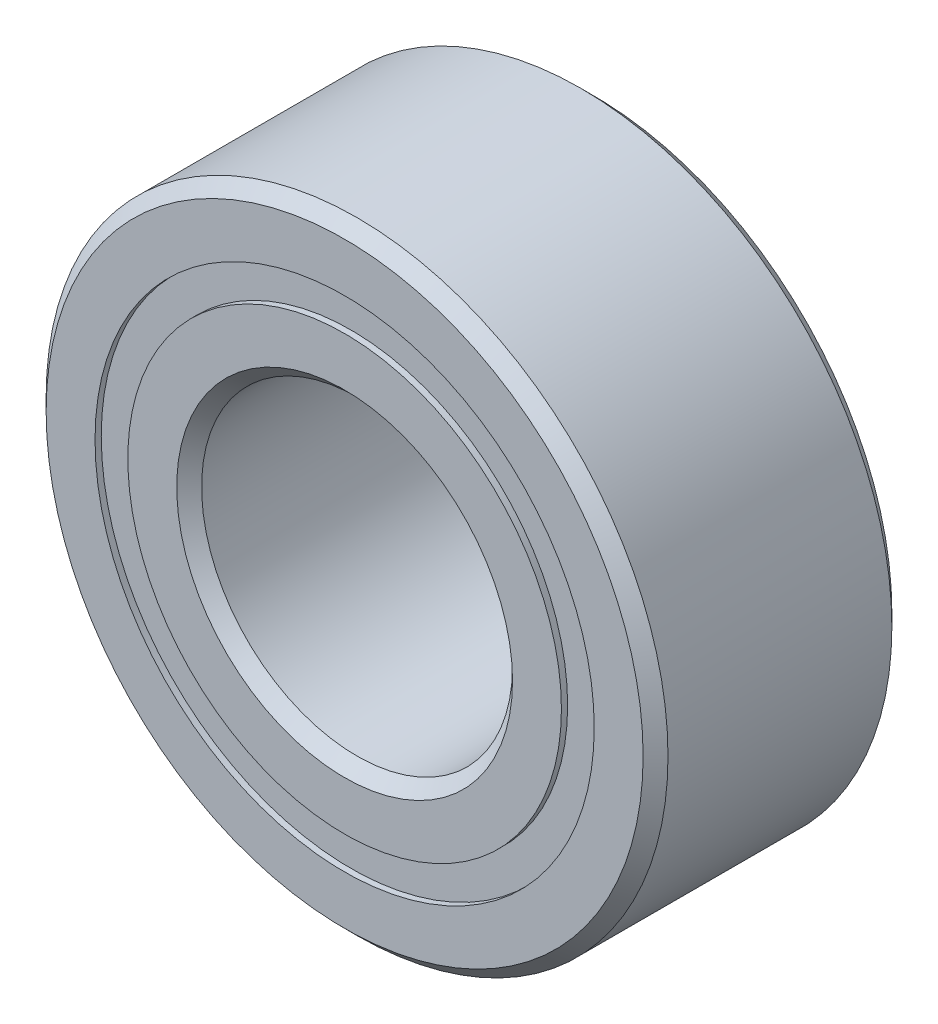
ISO-10303-21;
HEADER;
FILE_DESCRIPTION(('STEP AP214'),'2;1');
FILE_NAME('part.step','',(''),(''),'','','');
FILE_SCHEMA(('AUTOMOTIVE_DESIGN { 1 0 10303 214 1 1 1 1 }'));
ENDSEC;
DATA;
#1=APPLICATION_CONTEXT('core data for automotive mechanical design processes');
#2=APPLICATION_PROTOCOL_DEFINITION('international standard','automotive_design',2000,#1);
#3=PRODUCT_CONTEXT('',#1,'mechanical');
#4=PRODUCT('Part','Part','',(#3));
#5=PRODUCT_RELATED_PRODUCT_CATEGORY('part','',(#4));
#6=PRODUCT_DEFINITION_FORMATION('','',#4);
#7=PRODUCT_DEFINITION_CONTEXT('part definition',#1,'design');
#8=PRODUCT_DEFINITION('design','',#6,#7);
#9=PRODUCT_DEFINITION_SHAPE('','',#8);
#10=(LENGTH_UNIT() NAMED_UNIT(*) SI_UNIT(.MILLI.,.METRE.));
#11=(NAMED_UNIT(*) PLANE_ANGLE_UNIT() SI_UNIT($,.RADIAN.));
#12=(NAMED_UNIT(*) SI_UNIT($,.STERADIAN.) SOLID_ANGLE_UNIT());
#13=UNCERTAINTY_MEASURE_WITH_UNIT(LENGTH_MEASURE(1.E-05),#10,'distance_accuracy_value','');
#14=(GEOMETRIC_REPRESENTATION_CONTEXT(3) GLOBAL_UNCERTAINTY_ASSIGNED_CONTEXT((#13)) GLOBAL_UNIT_ASSIGNED_CONTEXT((#10,
#11,#12)) REPRESENTATION_CONTEXT('',''));
#15=CARTESIAN_POINT('',(0.,0.,0.));
#16=DIRECTION('',(0.,0.,1.));
#17=DIRECTION('',(1.,0.,0.));
#18=AXIS2_PLACEMENT_3D('',#15,#16,#17);
#19=CARTESIAN_POINT('',(0.,4.01373626373626,-1.9));
#20=DIRECTION('',(0.,0.,1.));
#21=DIRECTION('',(1.,0.,0.));
#22=AXIS2_PLACEMENT_3D('',#19,#20,#21);
#23=PLANE('',#22);
#24=CARTESIAN_POINT('',(0.,0.,-1.9));
#25=DIRECTION('',(0.,0.,1.));
#26=DIRECTION('',(1.,0.,0.));
#27=AXIS2_PLACEMENT_3D('',#24,#25,#26);
#28=CIRCLE('',#27,4.01373626373626);
#29=CARTESIAN_POINT('',(4.01373626373626,0.,-1.9));
#30=VERTEX_POINT('',#29);
#31=EDGE_CURVE('E64',#30,#30,#28,.T.);
#32=ORIENTED_EDGE('',*,*,#31,.F.);
#33=EDGE_LOOP('',(#32));
#34=FACE_BOUND('',#33,.T.);
#35=CARTESIAN_POINT('',(0.,0.,-1.9));
#36=DIRECTION('',(0.,0.,1.));
#37=DIRECTION('',(1.,0.,0.));
#38=AXIS2_PLACEMENT_3D('',#35,#36,#37);
#39=CIRCLE('',#38,3.48626373626374);
#40=CARTESIAN_POINT('',(3.48626373626374,0.,-1.9));
#41=VERTEX_POINT('',#40);
#42=EDGE_CURVE('E11',#41,#41,#39,.T.);
#43=ORIENTED_EDGE('',*,*,#42,.T.);
#44=EDGE_LOOP('',(#43));
#45=FACE_BOUND('',#44,.T.);
#46=ADVANCED_FACE('F50',(#34,#45),#23,.F.);
#47=CARTESIAN_POINT('',(0.,0.,2.));
#48=DIRECTION('',(0.,0.,1.));
#49=DIRECTION('',(1.,0.,0.));
#50=AXIS2_PLACEMENT_3D('',#47,#48,#49);
#51=CYLINDRICAL_SURFACE('',#50,3.48626373626374);
#52=ORIENTED_EDGE('',*,*,#42,.F.);
#53=EDGE_LOOP('',(#52));
#54=FACE_BOUND('',#53,.T.);
#55=CARTESIAN_POINT('',(0.,0.,-0.927189448602435));
#56=DIRECTION('',(0.,0.,1.));
#57=DIRECTION('',(1.,0.,0.));
#58=AXIS2_PLACEMENT_3D('',#55,#56,#57);
#59=CIRCLE('',#58,3.48626373626374);
#60=CARTESIAN_POINT('',(3.48626373626374,0.,-0.927189448602435));
#61=VERTEX_POINT('',#60);
#62=EDGE_CURVE('E56',#61,#61,#59,.T.);
#63=ORIENTED_EDGE('',*,*,#62,.T.);
#64=EDGE_LOOP('',(#63));
#65=FACE_BOUND('',#64,.T.);
#66=ADVANCED_FACE('F73',(#54,#65),#51,.F.);
#67=CARTESIAN_POINT('',(0.,4.01373626373626,-0.927189448602435));
#68=DIRECTION('',(0.,0.,-1.));
#69=DIRECTION('',(-1.,0.,0.));
#70=AXIS2_PLACEMENT_3D('',#67,#68,#69);
#71=PLANE('',#70);
#72=ORIENTED_EDGE('',*,*,#62,.F.);
#73=EDGE_LOOP('',(#72));
#74=FACE_BOUND('',#73,.T.);
#75=CARTESIAN_POINT('',(0.,0.,-0.927189448602435));
#76=DIRECTION('',(0.,0.,1.));
#77=DIRECTION('',(1.,0.,0.));
#78=AXIS2_PLACEMENT_3D('',#75,#76,#77);
#79=CIRCLE('',#78,4.01373626373626);
#80=CARTESIAN_POINT('',(4.01373626373626,0.,-0.927189448602435));
#81=VERTEX_POINT('',#80);
#82=EDGE_CURVE('E60',#81,#81,#79,.T.);
#83=ORIENTED_EDGE('',*,*,#82,.T.);
#84=EDGE_LOOP('',(#83));
#85=FACE_BOUND('',#84,.T.);
#86=ADVANCED_FACE('F77',(#74,#85),#71,.F.);
#87=CARTESIAN_POINT('',(0.,0.,2.));
#88=DIRECTION('',(0.,0.,1.));
#89=DIRECTION('',(1.,0.,0.));
#90=AXIS2_PLACEMENT_3D('',#87,#88,#89);
#91=CYLINDRICAL_SURFACE('',#90,4.01373626373626);
#92=ORIENTED_EDGE('',*,*,#82,.F.);
#93=EDGE_LOOP('',(#92));
#94=FACE_BOUND('',#93,.T.);
#95=ORIENTED_EDGE('',*,*,#31,.T.);
#96=EDGE_LOOP('',(#95));
#97=FACE_BOUND('',#96,.T.);
#98=ADVANCED_FACE('F70',(#94,#97),#91,.T.);
#99=CLOSED_SHELL('',(#46,#66,#86,#98));
#100=MANIFOLD_SOLID_BREP('B2',#99);
#101=CARTESIAN_POINT('',(0.,4.01373626373626,1.9));
#102=DIRECTION('',(0.,0.,-1.));
#103=DIRECTION('',(-1.,0.,0.));
#104=AXIS2_PLACEMENT_3D('',#101,#102,#103);
#105=PLANE('',#104);
#106=CARTESIAN_POINT('',(0.,0.,1.9));
#107=DIRECTION('',(0.,0.,1.));
#108=DIRECTION('',(1.,0.,0.));
#109=AXIS2_PLACEMENT_3D('',#106,#107,#108);
#110=CIRCLE('',#109,3.48626373626374);
#111=CARTESIAN_POINT('',(3.48626373626374,0.,1.9));
#112=VERTEX_POINT('',#111);
#113=EDGE_CURVE('E49',#112,#112,#110,.T.);
#114=ORIENTED_EDGE('',*,*,#113,.F.);
#115=EDGE_LOOP('',(#114));
#116=FACE_BOUND('',#115,.T.);
#117=CARTESIAN_POINT('',(0.,0.,1.9));
#118=DIRECTION('',(0.,0.,1.));
#119=DIRECTION('',(1.,0.,0.));
#120=AXIS2_PLACEMENT_3D('',#117,#118,#119);
#121=CIRCLE('',#120,4.01373626373626);
#122=CARTESIAN_POINT('',(4.01373626373626,0.,1.9));
#123=VERTEX_POINT('',#122);
#124=EDGE_CURVE('E124',#123,#123,#121,.T.);
#125=ORIENTED_EDGE('',*,*,#124,.T.);
#126=EDGE_LOOP('',(#125));
#127=FACE_BOUND('',#126,.T.);
#128=ADVANCED_FACE('F110',(#116,#127),#105,.F.);
#129=CARTESIAN_POINT('',(0.,0.,2.));
#130=DIRECTION('',(0.,0.,1.));
#131=DIRECTION('',(1.,0.,0.));
#132=AXIS2_PLACEMENT_3D('',#129,#130,#131);
#133=CYLINDRICAL_SURFACE('',#132,3.48626373626374);
#134=CARTESIAN_POINT('',(0.,0.,0.927189448602435));
#135=DIRECTION('',(0.,0.,1.));
#136=DIRECTION('',(1.,0.,0.));
#137=AXIS2_PLACEMENT_3D('',#134,#135,#136);
#138=CIRCLE('',#137,3.48626373626374);
#139=CARTESIAN_POINT('',(3.48626373626374,0.,0.927189448602435));
#140=VERTEX_POINT('',#139);
#141=EDGE_CURVE('E116',#140,#140,#138,.T.);
#142=ORIENTED_EDGE('',*,*,#141,.F.);
#143=EDGE_LOOP('',(#142));
#144=FACE_BOUND('',#143,.T.);
#145=ORIENTED_EDGE('',*,*,#113,.T.);
#146=EDGE_LOOP('',(#145));
#147=FACE_BOUND('',#146,.T.);
#148=ADVANCED_FACE('F139',(#144,#147),#133,.F.);
#149=CARTESIAN_POINT('',(0.,4.01373626373626,0.927189448602435));
#150=DIRECTION('',(0.,0.,1.));
#151=DIRECTION('',(1.,0.,0.));
#152=AXIS2_PLACEMENT_3D('',#149,#150,#151);
#153=PLANE('',#152);
#154=CARTESIAN_POINT('',(0.,0.,0.927189448602435));
#155=DIRECTION('',(0.,0.,1.));
#156=DIRECTION('',(1.,0.,0.));
#157=AXIS2_PLACEMENT_3D('',#154,#155,#156);
#158=CIRCLE('',#157,4.01373626373626);
#159=CARTESIAN_POINT('',(4.01373626373626,0.,0.927189448602435));
#160=VERTEX_POINT('',#159);
#161=EDGE_CURVE('E120',#160,#160,#158,.T.);
#162=ORIENTED_EDGE('',*,*,#161,.F.);
#163=EDGE_LOOP('',(#162));
#164=FACE_BOUND('',#163,.T.);
#165=ORIENTED_EDGE('',*,*,#141,.T.);
#166=EDGE_LOOP('',(#165));
#167=FACE_BOUND('',#166,.T.);
#168=ADVANCED_FACE('F134',(#164,#167),#153,.F.);
#169=CARTESIAN_POINT('',(0.,0.,2.));
#170=DIRECTION('',(0.,0.,1.));
#171=DIRECTION('',(1.,0.,0.));
#172=AXIS2_PLACEMENT_3D('',#169,#170,#171);
#173=CYLINDRICAL_SURFACE('',#172,4.01373626373626);
#174=ORIENTED_EDGE('',*,*,#124,.F.);
#175=EDGE_LOOP('',(#174));
#176=FACE_BOUND('',#175,.T.);
#177=ORIENTED_EDGE('',*,*,#161,.T.);
#178=EDGE_LOOP('',(#177));
#179=FACE_BOUND('',#178,.T.);
#180=ADVANCED_FACE('F131',(#176,#179),#173,.T.);
#181=CLOSED_SHELL('',(#128,#148,#168,#180));
#182=MANIFOLD_SOLID_BREP('B6',#181);
#183=CARTESIAN_POINT('',(-1.87499999999996,3.24759526419167,0.));
#184=DIRECTION('',(0.,0.,1.));
#185=DIRECTION('',(-0.499999999999989,0.866025403784445,0.));
#186=AXIS2_PLACEMENT_3D('',#183,#184,#185);
#187=SPHERICAL_SURFACE('',#186,0.927189448602435);
#188=CARTESIAN_POINT('',(-1.87499999999996,3.24759526419167,0.927189448602435));
#189=VERTEX_POINT('',#188);
#190=VERTEX_LOOP('',#189);
#191=FACE_BOUND('',#190,.T.);
#192=ADVANCED_FACE('F170',(#191),#187,.T.);
#193=CLOSED_SHELL('',(#192));
#194=MANIFOLD_SOLID_BREP('B44',#193);
#195=CARTESIAN_POINT('',(-3.24759526419162,1.87500000000004,0.));
#196=DIRECTION('',(0.,0.,1.));
#197=DIRECTION('',(-0.866025403784433,0.50000000000001,0.));
#198=AXIS2_PLACEMENT_3D('',#195,#196,#197);
#199=SPHERICAL_SURFACE('',#198,0.927189448602435);
#200=CARTESIAN_POINT('',(-3.24759526419162,1.87500000000004,0.927189448602435));
#201=VERTEX_POINT('',#200);
#202=VERTEX_LOOP('',#201);
#203=FACE_BOUND('',#202,.T.);
#204=ADVANCED_FACE('F193',(#203),#199,.T.);
#205=CLOSED_SHELL('',(#204));
#206=MANIFOLD_SOLID_BREP('B106',#205);
#207=CARTESIAN_POINT('',(-3.75,0.,0.));
#208=DIRECTION('',(0.,0.,1.));
#209=DIRECTION('',(-1.,0.,0.));
#210=AXIS2_PLACEMENT_3D('',#207,#208,#209);
#211=SPHERICAL_SURFACE('',#210,0.927189448602435);
#212=CARTESIAN_POINT('',(-3.75,0.,0.927189448602435));
#213=VERTEX_POINT('',#212);
#214=VERTEX_LOOP('',#213);
#215=FACE_BOUND('',#214,.T.);
#216=ADVANCED_FACE('F216',(#215),#211,.T.);
#217=CLOSED_SHELL('',(#216));
#218=MANIFOLD_SOLID_BREP('B166',#217);
#219=CARTESIAN_POINT('',(-3.24759526419166,-1.87499999999997,0.));
#220=DIRECTION('',(0.,0.,1.));
#221=DIRECTION('',(-0.866025403784443,-0.499999999999992,0.));
#222=AXIS2_PLACEMENT_3D('',#219,#220,#221);
#223=SPHERICAL_SURFACE('',#222,0.927189448602435);
#224=CARTESIAN_POINT('',(-3.24759526419166,-1.87499999999997,0.927189448602435));
#225=VERTEX_POINT('',#224);
#226=VERTEX_LOOP('',#225);
#227=FACE_BOUND('',#226,.T.);
#228=ADVANCED_FACE('F239',(#227),#223,.T.);
#229=CLOSED_SHELL('',(#228));
#230=MANIFOLD_SOLID_BREP('B189',#229);
#231=CARTESIAN_POINT('',(-1.87500000000003,-3.24759526419163,0.));
#232=DIRECTION('',(0.,0.,1.));
#233=DIRECTION('',(-0.500000000000007,-0.866025403784435,0.));
#234=AXIS2_PLACEMENT_3D('',#231,#232,#233);
#235=SPHERICAL_SURFACE('',#234,0.927189448602435);
#236=CARTESIAN_POINT('',(-1.87500000000003,-3.24759526419163,0.927189448602435));
#237=VERTEX_POINT('',#236);
#238=VERTEX_LOOP('',#237);
#239=FACE_BOUND('',#238,.T.);
#240=ADVANCED_FACE('F262',(#239),#235,.T.);
#241=CLOSED_SHELL('',(#240));
#242=MANIFOLD_SOLID_BREP('B212',#241);
#243=CARTESIAN_POINT('',(0.,-3.75,0.));
#244=DIRECTION('',(0.,0.,1.));
#245=DIRECTION('',(0.,-1.,0.));
#246=AXIS2_PLACEMENT_3D('',#243,#244,#245);
#247=SPHERICAL_SURFACE('',#246,0.927189448602435);
#248=CARTESIAN_POINT('',(0.,-3.75,0.927189448602435));
#249=VERTEX_POINT('',#248);
#250=VERTEX_LOOP('',#249);
#251=FACE_BOUND('',#250,.T.);
#252=ADVANCED_FACE('F285',(#251),#247,.T.);
#253=CLOSED_SHELL('',(#252));
#254=MANIFOLD_SOLID_BREP('B235',#253);
#255=CARTESIAN_POINT('',(1.87499999999998,-3.24759526419166,0.));
#256=DIRECTION('',(0.,0.,1.));
#257=DIRECTION('',(0.499999999999995,-0.866025403784442,0.));
#258=AXIS2_PLACEMENT_3D('',#255,#256,#257);
#259=SPHERICAL_SURFACE('',#258,0.927189448602435);
#260=CARTESIAN_POINT('',(1.87499999999998,-3.24759526419166,0.927189448602435));
#261=VERTEX_POINT('',#260);
#262=VERTEX_LOOP('',#261);
#263=FACE_BOUND('',#262,.T.);
#264=ADVANCED_FACE('F308',(#263),#259,.T.);
#265=CLOSED_SHELL('',(#264));
#266=MANIFOLD_SOLID_BREP('B258',#265);
#267=CARTESIAN_POINT('',(3.24759526419164,-1.87500000000002,0.));
#268=DIRECTION('',(0.,0.,1.));
#269=DIRECTION('',(0.866025403784436,-0.500000000000004,0.));
#270=AXIS2_PLACEMENT_3D('',#267,#268,#269);
#271=SPHERICAL_SURFACE('',#270,0.927189448602435);
#272=CARTESIAN_POINT('',(3.24759526419164,-1.87500000000002,0.927189448602435));
#273=VERTEX_POINT('',#272);
#274=VERTEX_LOOP('',#273);
#275=FACE_BOUND('',#274,.T.);
#276=ADVANCED_FACE('F331',(#275),#271,.T.);
#277=CLOSED_SHELL('',(#276));
#278=MANIFOLD_SOLID_BREP('B281',#277);
#279=CARTESIAN_POINT('',(3.75,0.,0.));
#280=DIRECTION('',(0.,0.,1.));
#281=DIRECTION('',(1.,0.,0.));
#282=AXIS2_PLACEMENT_3D('',#279,#280,#281);
#283=SPHERICAL_SURFACE('',#282,0.927189448602435);
#284=CARTESIAN_POINT('',(3.75,0.,0.927189448602435));
#285=VERTEX_POINT('',#284);
#286=VERTEX_LOOP('',#285);
#287=FACE_BOUND('',#286,.T.);
#288=ADVANCED_FACE('F354',(#287),#283,.T.);
#289=CLOSED_SHELL('',(#288));
#290=MANIFOLD_SOLID_BREP('B304',#289);
#291=CARTESIAN_POINT('',(3.24759526419165,1.87499999999999,0.));
#292=DIRECTION('',(0.,0.,1.));
#293=DIRECTION('',(0.86602540378444,0.499999999999998,0.));
#294=AXIS2_PLACEMENT_3D('',#291,#292,#293);
#295=SPHERICAL_SURFACE('',#294,0.927189448602435);
#296=CARTESIAN_POINT('',(3.24759526419165,1.87499999999999,0.927189448602435));
#297=VERTEX_POINT('',#296);
#298=VERTEX_LOOP('',#297);
#299=FACE_BOUND('',#298,.T.);
#300=ADVANCED_FACE('F377',(#299),#295,.T.);
#301=CLOSED_SHELL('',(#300));
#302=MANIFOLD_SOLID_BREP('B327',#301);
#303=CARTESIAN_POINT('',(1.875,3.24759526419164,0.));
#304=DIRECTION('',(0.,0.,1.));
#305=DIRECTION('',(0.500000000000001,0.866025403784438,0.));
#306=AXIS2_PLACEMENT_3D('',#303,#304,#305);
#307=SPHERICAL_SURFACE('',#306,0.927189448602435);
#308=CARTESIAN_POINT('',(1.875,3.24759526419164,0.927189448602435));
#309=VERTEX_POINT('',#308);
#310=VERTEX_LOOP('',#309);
#311=FACE_BOUND('',#310,.T.);
#312=ADVANCED_FACE('F400',(#311),#307,.T.);
#313=CLOSED_SHELL('',(#312));
#314=MANIFOLD_SOLID_BREP('B350',#313);
#315=CARTESIAN_POINT('',(0.,3.75,0.));
#316=DIRECTION('',(0.,0.,1.));
#317=DIRECTION('',(0.,1.,0.));
#318=AXIS2_PLACEMENT_3D('',#315,#316,#317);
#319=SPHERICAL_SURFACE('',#318,0.927189448602435);
#320=CARTESIAN_POINT('',(0.,3.75,0.927189448602435));
#321=VERTEX_POINT('',#320);
#322=VERTEX_LOOP('',#321);
#323=FACE_BOUND('',#322,.T.);
#324=ADVANCED_FACE('F425',(#323),#319,.T.);
#325=CLOSED_SHELL('',(#324));
#326=MANIFOLD_SOLID_BREP('B373',#325);
#327=CARTESIAN_POINT('',(0.,3.48626373626374,2.));
#328=DIRECTION('',(0.,0.,-1.));
#329=DIRECTION('',(-1.,0.,0.));
#330=AXIS2_PLACEMENT_3D('',#327,#328,#329);
#331=PLANE('',#330);
#332=CARTESIAN_POINT('',(0.,0.,2.));
#333=DIRECTION('',(0.,0.,1.));
#334=DIRECTION('',(1.,0.,0.));
#335=AXIS2_PLACEMENT_3D('',#332,#333,#334);
#336=CIRCLE('',#335,2.7);
#337=CARTESIAN_POINT('',(2.7,0.,2.));
#338=VERTEX_POINT('',#337);
#339=EDGE_CURVE('E471',#338,#338,#336,.T.);
#340=ORIENTED_EDGE('',*,*,#339,.F.);
#341=EDGE_LOOP('',(#340));
#342=FACE_BOUND('',#341,.T.);
#343=CARTESIAN_POINT('',(0.,0.,2.));
#344=DIRECTION('',(0.,0.,1.));
#345=DIRECTION('',(1.,0.,0.));
#346=AXIS2_PLACEMENT_3D('',#343,#344,#345);
#347=CIRCLE('',#346,3.48626373626374);
#348=CARTESIAN_POINT('',(3.48626373626374,0.,2.));
#349=VERTEX_POINT('',#348);
#350=EDGE_CURVE('E424',#349,#349,#347,.T.);
#351=ORIENTED_EDGE('',*,*,#350,.T.);
#352=EDGE_LOOP('',(#351));
#353=FACE_BOUND('',#352,.T.);
#354=ADVANCED_FACE('F443',(#342,#353),#331,.F.);
#355=CARTESIAN_POINT('',(0.,0.,2.));
#356=DIRECTION('',(0.,0.,1.));
#357=DIRECTION('',(1.,0.,0.));
#358=AXIS2_PLACEMENT_3D('',#355,#356,#357);
#359=CYLINDRICAL_SURFACE('',#358,3.48626373626374);
#360=ORIENTED_EDGE('',*,*,#350,.F.);
#361=EDGE_LOOP('',(#360));
#362=FACE_BOUND('',#361,.T.);
#363=CARTESIAN_POINT('',(0.,0.,0.888888888888889));
#364=DIRECTION('',(0.,0.,1.));
#365=DIRECTION('',(1.,0.,0.));
#366=AXIS2_PLACEMENT_3D('',#363,#364,#365);
#367=CIRCLE('',#366,3.48626373626374);
#368=CARTESIAN_POINT('',(3.48626373626374,0.,0.888888888888889));
#369=VERTEX_POINT('',#368);
#370=EDGE_CURVE('E449',#369,#369,#367,.T.);
#371=ORIENTED_EDGE('',*,*,#370,.T.);
#372=EDGE_LOOP('',(#371));
#373=FACE_BOUND('',#372,.T.);
#374=ADVANCED_FACE('F478',(#362,#373),#359,.T.);
#375=CARTESIAN_POINT('',(0.,0.,0.));
#376=DIRECTION('',(0.,0.,1.));
#377=DIRECTION('',(1.,0.,0.));
#378=AXIS2_PLACEMENT_3D('',#375,#376,#377);
#379=TOROIDAL_SURFACE('',#378,3.75,0.927189448602434);
#380=ORIENTED_EDGE('',*,*,#370,.F.);
#381=EDGE_LOOP('',(#380));
#382=FACE_BOUND('',#381,.T.);
#383=CARTESIAN_POINT('',(0.,0.,-0.88888888888889));
#384=DIRECTION('',(0.,0.,1.));
#385=DIRECTION('',(1.,0.,0.));
#386=AXIS2_PLACEMENT_3D('',#383,#384,#385);
#387=CIRCLE('',#386,3.48626373626374);
#388=CARTESIAN_POINT('',(3.48626373626374,0.,-0.88888888888889));
#389=VERTEX_POINT('',#388);
#390=EDGE_CURVE('E453',#389,#389,#387,.T.);
#391=ORIENTED_EDGE('',*,*,#390,.T.);
#392=EDGE_LOOP('',(#391));
#393=FACE_BOUND('',#392,.T.);
#394=ADVANCED_FACE('F482',(#382,#393),#379,.F.);
#395=CARTESIAN_POINT('',(0.,0.,2.));
#396=DIRECTION('',(0.,0.,1.));
#397=DIRECTION('',(1.,0.,0.));
#398=AXIS2_PLACEMENT_3D('',#395,#396,#397);
#399=CYLINDRICAL_SURFACE('',#398,3.48626373626374);
#400=ORIENTED_EDGE('',*,*,#390,.F.);
#401=EDGE_LOOP('',(#400));
#402=FACE_BOUND('',#401,.T.);
#403=CARTESIAN_POINT('',(0.,0.,-2.));
#404=DIRECTION('',(0.,0.,1.));
#405=DIRECTION('',(1.,0.,0.));
#406=AXIS2_PLACEMENT_3D('',#403,#404,#405);
#407=CIRCLE('',#406,3.48626373626374);
#408=CARTESIAN_POINT('',(3.48626373626374,0.,-2.));
#409=VERTEX_POINT('',#408);
#410=EDGE_CURVE('E457',#409,#409,#407,.T.);
#411=ORIENTED_EDGE('',*,*,#410,.T.);
#412=EDGE_LOOP('',(#411));
#413=FACE_BOUND('',#412,.T.);
#414=ADVANCED_FACE('F487',(#402,#413),#399,.T.);
#415=CARTESIAN_POINT('',(0.,2.7,-2.));
#416=DIRECTION('',(0.,0.,1.));
#417=DIRECTION('',(1.,0.,0.));
#418=AXIS2_PLACEMENT_3D('',#415,#416,#417);
#419=PLANE('',#418);
#420=ORIENTED_EDGE('',*,*,#410,.F.);
#421=EDGE_LOOP('',(#420));
#422=FACE_BOUND('',#421,.T.);
#423=CARTESIAN_POINT('',(0.,0.,-2.));
#424=DIRECTION('',(0.,0.,1.));
#425=DIRECTION('',(1.,0.,0.));
#426=AXIS2_PLACEMENT_3D('',#423,#424,#425);
#427=CIRCLE('',#426,2.7);
#428=CARTESIAN_POINT('',(2.7,0.,-2.));
#429=VERTEX_POINT('',#428);
#430=EDGE_CURVE('E462',#429,#429,#427,.T.);
#431=ORIENTED_EDGE('',*,*,#430,.T.);
#432=EDGE_LOOP('',(#431));
#433=FACE_BOUND('',#432,.T.);
#434=ADVANCED_FACE('F493',(#422,#433),#419,.F.);
#435=CARTESIAN_POINT('',(0.,0.,-1.8));
#436=DIRECTION('',(0.,0.,-1.));
#437=DIRECTION('',(-1.,0.,0.));
#438=AXIS2_PLACEMENT_3D('',#435,#436,#437);
#439=CONICAL_SURFACE('',#438,2.5,0.785398163397443);
#440=ORIENTED_EDGE('',*,*,#430,.F.);
#441=EDGE_LOOP('',(#440));
#442=FACE_BOUND('',#441,.T.);
#443=CARTESIAN_POINT('',(0.,0.,-1.8));
#444=DIRECTION('',(0.,0.,1.));
#445=DIRECTION('',(1.,0.,0.));
#446=AXIS2_PLACEMENT_3D('',#443,#444,#445);
#447=CIRCLE('',#446,2.5);
#448=CARTESIAN_POINT('',(2.5,0.,-1.8));
#449=VERTEX_POINT('',#448);
#450=EDGE_CURVE('E465',#449,#449,#447,.T.);
#451=ORIENTED_EDGE('',*,*,#450,.T.);
#452=EDGE_LOOP('',(#451));
#453=FACE_BOUND('',#452,.T.);
#454=ADVANCED_FACE('F497',(#442,#453),#439,.F.);
#455=CARTESIAN_POINT('',(0.,0.,2.));
#456=DIRECTION('',(0.,0.,1.));
#457=DIRECTION('',(1.,0.,0.));
#458=AXIS2_PLACEMENT_3D('',#455,#456,#457);
#459=CYLINDRICAL_SURFACE('',#458,2.5);
#460=ORIENTED_EDGE('',*,*,#450,.F.);
#461=EDGE_LOOP('',(#460));
#462=FACE_BOUND('',#461,.T.);
#463=CARTESIAN_POINT('',(0.,0.,1.8));
#464=DIRECTION('',(0.,0.,1.));
#465=DIRECTION('',(1.,0.,0.));
#466=AXIS2_PLACEMENT_3D('',#463,#464,#465);
#467=CIRCLE('',#466,2.5);
#468=CARTESIAN_POINT('',(2.5,0.,1.8));
#469=VERTEX_POINT('',#468);
#470=EDGE_CURVE('E468',#469,#469,#467,.T.);
#471=ORIENTED_EDGE('',*,*,#470,.T.);
#472=EDGE_LOOP('',(#471));
#473=FACE_BOUND('',#472,.T.);
#474=ADVANCED_FACE('F501',(#462,#473),#459,.F.);
#475=CARTESIAN_POINT('',(0.,0.,2.));
#476=DIRECTION('',(0.,0.,1.));
#477=DIRECTION('',(1.,0.,0.));
#478=AXIS2_PLACEMENT_3D('',#475,#476,#477);
#479=CONICAL_SURFACE('',#478,2.7,0.785398163397454);
#480=ORIENTED_EDGE('',*,*,#470,.F.);
#481=EDGE_LOOP('',(#480));
#482=FACE_BOUND('',#481,.T.);
#483=ORIENTED_EDGE('',*,*,#339,.T.);
#484=EDGE_LOOP('',(#483));
#485=FACE_BOUND('',#484,.T.);
#486=ADVANCED_FACE('F475',(#482,#485),#479,.F.);
#487=CLOSED_SHELL('',(#354,#374,#394,#414,#434,#454,#474,#486));
#488=MANIFOLD_SOLID_BREP('B396',#487);
#489=CARTESIAN_POINT('',(0.,0.,1.8));
#490=DIRECTION('',(0.,0.,-1.));
#491=DIRECTION('',(-1.,0.,0.));
#492=AXIS2_PLACEMENT_3D('',#489,#490,#491);
#493=CONICAL_SURFACE('',#492,5.,0.785398163397445);
#494=CARTESIAN_POINT('',(0.,0.,2.));
#495=DIRECTION('',(0.,0.,1.));
#496=DIRECTION('',(1.,0.,0.));
#497=AXIS2_PLACEMENT_3D('',#494,#495,#496);
#498=CIRCLE('',#497,4.8);
#499=CARTESIAN_POINT('',(4.8,0.,2.));
#500=VERTEX_POINT('',#499);
#501=EDGE_CURVE('E577',#500,#500,#498,.T.);
#502=ORIENTED_EDGE('',*,*,#501,.F.);
#503=EDGE_LOOP('',(#502));
#504=FACE_BOUND('',#503,.T.);
#505=CARTESIAN_POINT('',(0.,0.,1.8));
#506=DIRECTION('',(0.,0.,1.));
#507=DIRECTION('',(1.,0.,0.));
#508=AXIS2_PLACEMENT_3D('',#505,#506,#507);
#509=CIRCLE('',#508,5.);
#510=CARTESIAN_POINT('',(5.,0.,1.8));
#511=VERTEX_POINT('',#510);
#512=EDGE_CURVE('E442',#511,#511,#509,.T.);
#513=ORIENTED_EDGE('',*,*,#512,.T.);
#514=EDGE_LOOP('',(#513));
#515=FACE_BOUND('',#514,.T.);
#516=ADVANCED_FACE('F549',(#504,#515),#493,.T.);
#517=CARTESIAN_POINT('',(0.,0.,2.));
#518=DIRECTION('',(0.,0.,1.));
#519=DIRECTION('',(1.,0.,0.));
#520=AXIS2_PLACEMENT_3D('',#517,#518,#519);
#521=CYLINDRICAL_SURFACE('',#520,5.);
#522=ORIENTED_EDGE('',*,*,#512,.F.);
#523=EDGE_LOOP('',(#522));
#524=FACE_BOUND('',#523,.T.);
#525=CARTESIAN_POINT('',(0.,0.,-1.8));
#526=DIRECTION('',(0.,0.,1.));
#527=DIRECTION('',(1.,0.,0.));
#528=AXIS2_PLACEMENT_3D('',#525,#526,#527);
#529=CIRCLE('',#528,5.);
#530=CARTESIAN_POINT('',(5.,0.,-1.8));
#531=VERTEX_POINT('',#530);
#532=EDGE_CURVE('E555',#531,#531,#529,.T.);
#533=ORIENTED_EDGE('',*,*,#532,.T.);
#534=EDGE_LOOP('',(#533));
#535=FACE_BOUND('',#534,.T.);
#536=ADVANCED_FACE('F584',(#524,#535),#521,.T.);
#537=CARTESIAN_POINT('',(0.,0.,-2.));
#538=DIRECTION('',(0.,0.,1.));
#539=DIRECTION('',(1.,0.,0.));
#540=AXIS2_PLACEMENT_3D('',#537,#538,#539);
#541=CONICAL_SURFACE('',#540,4.8,0.785398163397444);
#542=ORIENTED_EDGE('',*,*,#532,.F.);
#543=EDGE_LOOP('',(#542));
#544=FACE_BOUND('',#543,.T.);
#545=CARTESIAN_POINT('',(0.,0.,-2.));
#546=DIRECTION('',(0.,0.,1.));
#547=DIRECTION('',(1.,0.,0.));
#548=AXIS2_PLACEMENT_3D('',#545,#546,#547);
#549=CIRCLE('',#548,4.8);
#550=CARTESIAN_POINT('',(4.8,0.,-2.));
#551=VERTEX_POINT('',#550);
#552=EDGE_CURVE('E559',#551,#551,#549,.T.);
#553=ORIENTED_EDGE('',*,*,#552,.T.);
#554=EDGE_LOOP('',(#553));
#555=FACE_BOUND('',#554,.T.);
#556=ADVANCED_FACE('F588',(#544,#555),#541,.T.);
#557=CARTESIAN_POINT('',(0.,4.8,-2.));
#558=DIRECTION('',(0.,0.,1.));
#559=DIRECTION('',(1.,0.,0.));
#560=AXIS2_PLACEMENT_3D('',#557,#558,#559);
#561=PLANE('',#560);
#562=ORIENTED_EDGE('',*,*,#552,.F.);
#563=EDGE_LOOP('',(#562));
#564=FACE_BOUND('',#563,.T.);
#565=CARTESIAN_POINT('',(0.,0.,-2.));
#566=DIRECTION('',(0.,0.,1.));
#567=DIRECTION('',(1.,0.,0.));
#568=AXIS2_PLACEMENT_3D('',#565,#566,#567);
#569=CIRCLE('',#568,4.01373626373626);
#570=CARTESIAN_POINT('',(4.01373626373626,0.,-2.));
#571=VERTEX_POINT('',#570);
#572=EDGE_CURVE('E563',#571,#571,#569,.T.);
#573=ORIENTED_EDGE('',*,*,#572,.T.);
#574=EDGE_LOOP('',(#573));
#575=FACE_BOUND('',#574,.T.);
#576=ADVANCED_FACE('F593',(#564,#575),#561,.F.);
#577=CARTESIAN_POINT('',(0.,0.,2.));
#578=DIRECTION('',(0.,0.,1.));
#579=DIRECTION('',(1.,0.,0.));
#580=AXIS2_PLACEMENT_3D('',#577,#578,#579);
#581=CYLINDRICAL_SURFACE('',#580,4.01373626373626);
#582=ORIENTED_EDGE('',*,*,#572,.F.);
#583=EDGE_LOOP('',(#582));
#584=FACE_BOUND('',#583,.T.);
#585=CARTESIAN_POINT('',(0.,0.,-0.888888888888889));
#586=DIRECTION('',(0.,0.,1.));
#587=DIRECTION('',(1.,0.,0.));
#588=AXIS2_PLACEMENT_3D('',#585,#586,#587);
#589=CIRCLE('',#588,4.01373626373626);
#590=CARTESIAN_POINT('',(4.01373626373626,0.,-0.888888888888889));
#591=VERTEX_POINT('',#590);
#592=EDGE_CURVE('E568',#591,#591,#589,.T.);
#593=ORIENTED_EDGE('',*,*,#592,.T.);
#594=EDGE_LOOP('',(#593));
#595=FACE_BOUND('',#594,.T.);
#596=ADVANCED_FACE('F599',(#584,#595),#581,.F.);
#597=CARTESIAN_POINT('',(0.,0.,0.));
#598=DIRECTION('',(0.,0.,1.));
#599=DIRECTION('',(1.,0.,0.));
#600=AXIS2_PLACEMENT_3D('',#597,#598,#599);
#601=TOROIDAL_SURFACE('',#600,3.75,0.927189448602435);
#602=ORIENTED_EDGE('',*,*,#592,.F.);
#603=EDGE_LOOP('',(#602));
#604=FACE_BOUND('',#603,.T.);
#605=CARTESIAN_POINT('',(0.,0.,0.888888888888889));
#606=DIRECTION('',(0.,0.,1.));
#607=DIRECTION('',(1.,0.,0.));
#608=AXIS2_PLACEMENT_3D('',#605,#606,#607);
#609=CIRCLE('',#608,4.01373626373626);
#610=CARTESIAN_POINT('',(4.01373626373626,0.,0.888888888888889));
#611=VERTEX_POINT('',#610);
#612=EDGE_CURVE('E571',#611,#611,#609,.T.);
#613=ORIENTED_EDGE('',*,*,#612,.T.);
#614=EDGE_LOOP('',(#613));
#615=FACE_BOUND('',#614,.T.);
#616=ADVANCED_FACE('F603',(#604,#615),#601,.F.);
#617=CARTESIAN_POINT('',(0.,0.,2.));
#618=DIRECTION('',(0.,0.,1.));
#619=DIRECTION('',(1.,0.,0.));
#620=AXIS2_PLACEMENT_3D('',#617,#618,#619);
#621=CYLINDRICAL_SURFACE('',#620,4.01373626373626);
#622=ORIENTED_EDGE('',*,*,#612,.F.);
#623=EDGE_LOOP('',(#622));
#624=FACE_BOUND('',#623,.T.);
#625=CARTESIAN_POINT('',(0.,0.,2.));
#626=DIRECTION('',(0.,0.,1.));
#627=DIRECTION('',(1.,0.,0.));
#628=AXIS2_PLACEMENT_3D('',#625,#626,#627);
#629=CIRCLE('',#628,4.01373626373626);
#630=CARTESIAN_POINT('',(4.01373626373626,0.,2.));
#631=VERTEX_POINT('',#630);
#632=EDGE_CURVE('E574',#631,#631,#629,.T.);
#633=ORIENTED_EDGE('',*,*,#632,.T.);
#634=EDGE_LOOP('',(#633));
#635=FACE_BOUND('',#634,.T.);
#636=ADVANCED_FACE('F607',(#624,#635),#621,.F.);
#637=CARTESIAN_POINT('',(0.,4.8,2.));
#638=DIRECTION('',(0.,0.,-1.));
#639=DIRECTION('',(-1.,0.,0.));
#640=AXIS2_PLACEMENT_3D('',#637,#638,#639);
#641=PLANE('',#640);
#642=ORIENTED_EDGE('',*,*,#632,.F.);
#643=EDGE_LOOP('',(#642));
#644=FACE_BOUND('',#643,.T.);
#645=ORIENTED_EDGE('',*,*,#501,.T.);
#646=EDGE_LOOP('',(#645));
#647=FACE_BOUND('',#646,.T.);
#648=ADVANCED_FACE('F581',(#644,#647),#641,.F.);
#649=CLOSED_SHELL('',(#516,#536,#556,#576,#596,#616,#636,#648));
#650=MANIFOLD_SOLID_BREP('B419',#649);
#651=ADVANCED_BREP_SHAPE_REPRESENTATION('',(#18,#100,#182,#194,#206,#218,#230,#242,#254,#266,
#278,#290,#302,#314,#326,#488,#650),#14);
#652=SHAPE_DEFINITION_REPRESENTATION(#9,#651);
ENDSEC;
END-ISO-10303-21;
